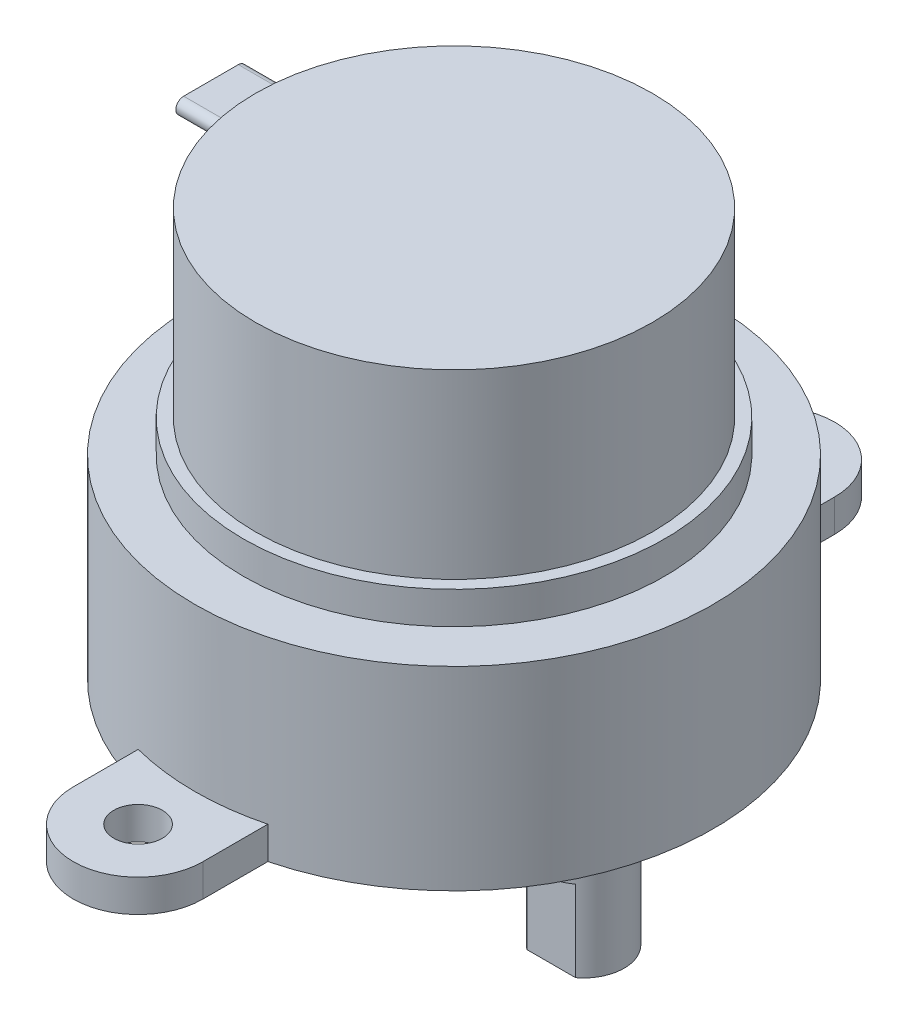
ISO-10303-21;
HEADER;
FILE_DESCRIPTION(('STEP AP214'),'2;1');
FILE_NAME('part.step','',(''),(''),'','','');
FILE_SCHEMA(('AUTOMOTIVE_DESIGN { 1 0 10303 214 1 1 1 1 }'));
ENDSEC;
DATA;
#1=APPLICATION_CONTEXT('core data for automotive mechanical design processes');
#2=APPLICATION_PROTOCOL_DEFINITION('international standard','automotive_design',2000,#1);
#3=PRODUCT_CONTEXT('',#1,'mechanical');
#4=PRODUCT('Part','Part','',(#3));
#5=PRODUCT_RELATED_PRODUCT_CATEGORY('part','',(#4));
#6=PRODUCT_DEFINITION_FORMATION('','',#4);
#7=PRODUCT_DEFINITION_CONTEXT('part definition',#1,'design');
#8=PRODUCT_DEFINITION('design','',#6,#7);
#9=PRODUCT_DEFINITION_SHAPE('','',#8);
#10=(LENGTH_UNIT() NAMED_UNIT(*) SI_UNIT(.MILLI.,.METRE.));
#11=(NAMED_UNIT(*) PLANE_ANGLE_UNIT() SI_UNIT($,.RADIAN.));
#12=(NAMED_UNIT(*) SI_UNIT($,.STERADIAN.) SOLID_ANGLE_UNIT());
#13=UNCERTAINTY_MEASURE_WITH_UNIT(LENGTH_MEASURE(1.E-05),#10,'distance_accuracy_value','');
#14=(GEOMETRIC_REPRESENTATION_CONTEXT(3) GLOBAL_UNCERTAINTY_ASSIGNED_CONTEXT((#13)) GLOBAL_UNIT_ASSIGNED_CONTEXT((#10,
#11,#12)) REPRESENTATION_CONTEXT('',''));
#15=CARTESIAN_POINT('',(0.,0.,0.));
#16=DIRECTION('',(0.,0.,1.));
#17=DIRECTION('',(1.,0.,0.));
#18=AXIS2_PLACEMENT_3D('',#15,#16,#17);
#19=CARTESIAN_POINT('',(8.,-10.2,0.));
#20=DIRECTION('',(0.,-1.,0.));
#21=DIRECTION('',(1.,0.,0.));
#22=AXIS2_PLACEMENT_3D('',#19,#20,#21);
#23=PLANE('',#22);
#24=DIRECTION('',(1.,0.,0.));
#25=VECTOR('',#24,1.);
#26=CARTESIAN_POINT('',(8.,-10.2,2.));
#27=LINE('',#26,#25);
#28=CARTESIAN_POINT('',(6.5,-10.2,2.));
#29=VERTEX_POINT('',#28);
#30=CARTESIAN_POINT('',(9.5,-10.2,2.));
#31=VERTEX_POINT('',#30);
#32=EDGE_CURVE('E247',#29,#31,#27,.T.);
#33=ORIENTED_EDGE('',*,*,#32,.F.);
#34=CARTESIAN_POINT('',(8.,-10.2,0.));
#35=DIRECTION('',(0.,1.,0.));
#36=DIRECTION('',(-1.,0.,0.));
#37=AXIS2_PLACEMENT_3D('',#34,#35,#36);
#38=CIRCLE('',#37,2.5);
#39=CARTESIAN_POINT('',(6.5,-10.2,-2.));
#40=VERTEX_POINT('',#39);
#41=EDGE_CURVE('E271',#40,#29,#38,.T.);
#42=ORIENTED_EDGE('',*,*,#41,.F.);
#43=DIRECTION('',(1.,0.,0.));
#44=VECTOR('',#43,1.);
#45=CARTESIAN_POINT('',(8.,-10.2,-2.));
#46=LINE('',#45,#44);
#47=CARTESIAN_POINT('',(9.5,-10.2,-2.));
#48=VERTEX_POINT('',#47);
#49=EDGE_CURVE('E249',#40,#48,#46,.T.);
#50=ORIENTED_EDGE('',*,*,#49,.T.);
#51=EDGE_CURVE('E274',#31,#48,#38,.T.);
#52=ORIENTED_EDGE('',*,*,#51,.F.);
#53=EDGE_LOOP('',(#33,#42,#50,#52));
#54=FACE_BOUND('',#53,.T.);
#55=CARTESIAN_POINT('',(8.,-10.2,0.));
#56=DIRECTION('',(0.,-1.,0.));
#57=DIRECTION('',(0.,0.,-1.));
#58=AXIS2_PLACEMENT_3D('',#55,#56,#57);
#59=CIRCLE('',#58,1.65);
#60=CARTESIAN_POINT('',(8.,-10.2,-1.65));
#61=VERTEX_POINT('',#60);
#62=EDGE_CURVE('E246',#61,#61,#59,.T.);
#63=ORIENTED_EDGE('',*,*,#62,.F.);
#64=EDGE_LOOP('',(#63));
#65=FACE_BOUND('',#64,.T.);
#66=ADVANCED_FACE('F43',(#54,#65),#23,.T.);
#67=CARTESIAN_POINT('',(8.,0.,0.));
#68=DIRECTION('',(0.,1.,0.));
#69=DIRECTION('',(-1.,0.,0.));
#70=AXIS2_PLACEMENT_3D('',#67,#68,#69);
#71=CYLINDRICAL_SURFACE('',#70,2.5);
#72=DIRECTION('',(0.,1.,0.));
#73=VECTOR('',#72,1.);
#74=CARTESIAN_POINT('',(6.5,0.,2.));
#75=LINE('',#74,#73);
#76=CARTESIAN_POINT('',(6.5,-5.2,2.));
#77=VERTEX_POINT('',#76);
#78=EDGE_CURVE('E311',#77,#29,#75,.F.);
#79=ORIENTED_EDGE('',*,*,#78,.F.);
#80=CARTESIAN_POINT('',(8.,-5.2,0.));
#81=DIRECTION('',(0.,-1.,0.));
#82=DIRECTION('',(1.,0.,0.));
#83=AXIS2_PLACEMENT_3D('',#80,#81,#82);
#84=CIRCLE('',#83,2.5);
#85=CARTESIAN_POINT('',(9.5,-5.2,2.));
#86=VERTEX_POINT('',#85);
#87=EDGE_CURVE('E305',#77,#86,#84,.F.);
#88=ORIENTED_EDGE('',*,*,#87,.T.);
#89=DIRECTION('',(0.,1.,0.));
#90=VECTOR('',#89,1.);
#91=CARTESIAN_POINT('',(9.5,0.,2.));
#92=LINE('',#91,#90);
#93=EDGE_CURVE('E308',#31,#86,#92,.T.);
#94=ORIENTED_EDGE('',*,*,#93,.F.);
#95=ORIENTED_EDGE('',*,*,#51,.T.);
#96=DIRECTION('',(0.,1.,0.));
#97=VECTOR('',#96,1.);
#98=CARTESIAN_POINT('',(9.5,0.,-2.));
#99=LINE('',#98,#97);
#100=CARTESIAN_POINT('',(9.5,-5.2,-2.));
#101=VERTEX_POINT('',#100);
#102=EDGE_CURVE('E299',#48,#101,#99,.T.);
#103=ORIENTED_EDGE('',*,*,#102,.T.);
#104=CARTESIAN_POINT('',(8.,-5.2,0.));
#105=DIRECTION('',(0.,-1.,0.));
#106=DIRECTION('',(1.,0.,0.));
#107=AXIS2_PLACEMENT_3D('',#104,#105,#106);
#108=CIRCLE('',#107,2.5);
#109=CARTESIAN_POINT('',(6.5,-5.2,-2.));
#110=VERTEX_POINT('',#109);
#111=EDGE_CURVE('E296',#101,#110,#108,.F.);
#112=ORIENTED_EDGE('',*,*,#111,.T.);
#113=DIRECTION('',(0.,1.,0.));
#114=VECTOR('',#113,1.);
#115=CARTESIAN_POINT('',(6.5,0.,-2.));
#116=LINE('',#115,#114);
#117=EDGE_CURVE('E302',#110,#40,#116,.F.);
#118=ORIENTED_EDGE('',*,*,#117,.T.);
#119=ORIENTED_EDGE('',*,*,#41,.T.);
#120=EDGE_LOOP('',(#79,#88,#94,#95,#103,#112,#118,#119));
#121=FACE_BOUND('',#120,.T.);
#122=CARTESIAN_POINT('',(8.,-2.7,0.));
#123=DIRECTION('',(0.,1.,0.));
#124=DIRECTION('',(-1.,0.,0.));
#125=AXIS2_PLACEMENT_3D('',#122,#123,#124);
#126=CIRCLE('',#125,2.5);
#127=CARTESIAN_POINT('',(5.5,-2.7,0.));
#128=VERTEX_POINT('',#127);
#129=EDGE_CURVE('E268',#128,#128,#126,.T.);
#130=ORIENTED_EDGE('',*,*,#129,.F.);
#131=EDGE_LOOP('',(#130));
#132=FACE_BOUND('',#131,.T.);
#133=ADVANCED_FACE('F421',(#121,#132),#71,.T.);
#134=CARTESIAN_POINT('',(0.,0.,0.));
#135=DIRECTION('',(0.,-1.,0.));
#136=DIRECTION('',(0.,0.,-1.));
#137=AXIS2_PLACEMENT_3D('',#134,#135,#136);
#138=PLANE('',#137);
#139=CARTESIAN_POINT('',(8.,0.,0.));
#140=DIRECTION('',(0.,-1.,0.));
#141=DIRECTION('',(0.,0.,-1.));
#142=AXIS2_PLACEMENT_3D('',#139,#140,#141);
#143=CIRCLE('',#142,4.5);
#144=CARTESIAN_POINT('',(8.,0.,-4.5));
#145=VERTEX_POINT('',#144);
#146=EDGE_CURVE('E293',#145,#145,#143,.T.);
#147=ORIENTED_EDGE('',*,*,#146,.F.);
#148=EDGE_LOOP('',(#147));
#149=FACE_BOUND('',#148,.T.);
#150=CARTESIAN_POINT('',(0.,0.,0.));
#151=DIRECTION('',(0.,1.,0.));
#152=DIRECTION('',(0.,0.,1.));
#153=AXIS2_PLACEMENT_3D('',#150,#151,#152);
#154=CIRCLE('',#153,16.);
#155=CARTESIAN_POINT('',(-4.,0.,-15.4919333848297));
#156=VERTEX_POINT('',#155);
#157=CARTESIAN_POINT('',(-4.00000000000001,0.,15.4919333848297));
#158=VERTEX_POINT('',#157);
#159=EDGE_CURVE('E290',#156,#158,#154,.T.);
#160=ORIENTED_EDGE('',*,*,#159,.F.);
#161=DIRECTION('',(0.,0.,-1.));
#162=VECTOR('',#161,1.);
#163=CARTESIAN_POINT('',(-4.00000000000001,0.,19.5));
#164=LINE('',#163,#162);
#165=CARTESIAN_POINT('',(-4.,0.,-19.5));
#166=VERTEX_POINT('',#165);
#167=EDGE_CURVE('E224',#156,#166,#164,.T.);
#168=ORIENTED_EDGE('',*,*,#167,.T.);
#169=CARTESIAN_POINT('',(0.,0.,-19.5));
#170=DIRECTION('',(0.,-1.,0.));
#171=DIRECTION('',(0.,0.,-1.));
#172=AXIS2_PLACEMENT_3D('',#169,#170,#171);
#173=CIRCLE('',#172,4.);
#174=CARTESIAN_POINT('',(4.00000000000001,0.,-19.5));
#175=VERTEX_POINT('',#174);
#176=EDGE_CURVE('E228',#166,#175,#173,.T.);
#177=ORIENTED_EDGE('',*,*,#176,.T.);
#178=DIRECTION('',(0.,0.,1.));
#179=VECTOR('',#178,1.);
#180=CARTESIAN_POINT('',(3.99999999999999,0.,19.5));
#181=LINE('',#180,#179);
#182=CARTESIAN_POINT('',(4.,0.,-15.4919333848297));
#183=VERTEX_POINT('',#182);
#184=EDGE_CURVE('E210',#175,#183,#181,.T.);
#185=ORIENTED_EDGE('',*,*,#184,.T.);
#186=CARTESIAN_POINT('',(3.99999999999999,0.,15.4919333848297));
#187=VERTEX_POINT('',#186);
#188=EDGE_CURVE('E291',#187,#183,#154,.T.);
#189=ORIENTED_EDGE('',*,*,#188,.F.);
#190=CARTESIAN_POINT('',(3.99999999999999,0.,19.5));
#191=VERTEX_POINT('',#190);
#192=EDGE_CURVE('E231',#187,#191,#181,.T.);
#193=ORIENTED_EDGE('',*,*,#192,.T.);
#194=CARTESIAN_POINT('',(0.,0.,19.5));
#195=DIRECTION('',(0.,-1.,0.));
#196=DIRECTION('',(0.,0.,-1.));
#197=AXIS2_PLACEMENT_3D('',#194,#195,#196);
#198=CIRCLE('',#197,4.);
#199=CARTESIAN_POINT('',(-4.00000000000001,0.,19.5));
#200=VERTEX_POINT('',#199);
#201=EDGE_CURVE('E203',#191,#200,#198,.T.);
#202=ORIENTED_EDGE('',*,*,#201,.T.);
#203=EDGE_CURVE('E225',#200,#158,#164,.T.);
#204=ORIENTED_EDGE('',*,*,#203,.T.);
#205=EDGE_LOOP('',(#160,#168,#177,#185,#189,#193,#202,#204));
#206=FACE_BOUND('',#205,.T.);
#207=CARTESIAN_POINT('',(0.,0.,-19.5));
#208=DIRECTION('',(0.,-1.,0.));
#209=DIRECTION('',(0.,0.,-1.));
#210=AXIS2_PLACEMENT_3D('',#207,#208,#209);
#211=CIRCLE('',#210,1.5);
#212=CARTESIAN_POINT('',(0.,0.,-21.));
#213=VERTEX_POINT('',#212);
#214=EDGE_CURVE('E197',#213,#213,#211,.T.);
#215=ORIENTED_EDGE('',*,*,#214,.F.);
#216=EDGE_LOOP('',(#215));
#217=FACE_BOUND('',#216,.T.);
#218=CARTESIAN_POINT('',(0.,0.,19.5));
#219=DIRECTION('',(0.,-1.,0.));
#220=DIRECTION('',(0.,0.,-1.));
#221=AXIS2_PLACEMENT_3D('',#218,#219,#220);
#222=CIRCLE('',#221,1.5);
#223=CARTESIAN_POINT('',(0.,0.,18.));
#224=VERTEX_POINT('',#223);
#225=EDGE_CURVE('E189',#224,#224,#222,.T.);
#226=ORIENTED_EDGE('',*,*,#225,.F.);
#227=EDGE_LOOP('',(#226));
#228=FACE_BOUND('',#227,.T.);
#229=ADVANCED_FACE('F45',(#149,#206,#217,#228),#138,.T.);
#230=CARTESIAN_POINT('',(0.,25.2,0.));
#231=DIRECTION('',(0.,1.,0.));
#232=DIRECTION('',(0.,0.,1.));
#233=AXIS2_PLACEMENT_3D('',#230,#231,#232);
#234=CYLINDRICAL_SURFACE('',#233,16.);
#235=DIRECTION('',(0.,1.,0.));
#236=VECTOR('',#235,1.);
#237=CARTESIAN_POINT('',(3.99999999999999,25.2,15.4919333848297));
#238=LINE('',#237,#236);
#239=CARTESIAN_POINT('',(3.99999999999999,2.,15.4919333848297));
#240=VERTEX_POINT('',#239);
#241=EDGE_CURVE('E325',#187,#240,#238,.T.);
#242=ORIENTED_EDGE('',*,*,#241,.F.);
#243=ORIENTED_EDGE('',*,*,#188,.T.);
#244=DIRECTION('',(0.,1.,0.));
#245=VECTOR('',#244,1.);
#246=CARTESIAN_POINT('',(4.,25.2,-15.4919333848297));
#247=LINE('',#246,#245);
#248=CARTESIAN_POINT('',(4.,2.,-15.4919333848297));
#249=VERTEX_POINT('',#248);
#250=EDGE_CURVE('E319',#249,#183,#247,.F.);
#251=ORIENTED_EDGE('',*,*,#250,.F.);
#252=CARTESIAN_POINT('',(0.,2.,0.));
#253=DIRECTION('',(0.,-1.,0.));
#254=DIRECTION('',(0.,0.,-1.));
#255=AXIS2_PLACEMENT_3D('',#252,#253,#254);
#256=CIRCLE('',#255,16.);
#257=CARTESIAN_POINT('',(-4.,2.,-15.4919333848297));
#258=VERTEX_POINT('',#257);
#259=EDGE_CURVE('E313',#249,#258,#256,.F.);
#260=ORIENTED_EDGE('',*,*,#259,.T.);
#261=DIRECTION('',(0.,1.,0.));
#262=VECTOR('',#261,1.);
#263=CARTESIAN_POINT('',(-4.,25.2,-15.4919333848297));
#264=LINE('',#263,#262);
#265=EDGE_CURVE('E315',#156,#258,#264,.T.);
#266=ORIENTED_EDGE('',*,*,#265,.F.);
#267=ORIENTED_EDGE('',*,*,#159,.T.);
#268=DIRECTION('',(0.,1.,0.));
#269=VECTOR('',#268,1.);
#270=CARTESIAN_POINT('',(-4.00000000000001,25.2,15.4919333848297));
#271=LINE('',#270,#269);
#272=CARTESIAN_POINT('',(-4.00000000000001,2.,15.4919333848297));
#273=VERTEX_POINT('',#272);
#274=EDGE_CURVE('E322',#273,#158,#271,.F.);
#275=ORIENTED_EDGE('',*,*,#274,.F.);
#276=EDGE_CURVE('E316',#273,#240,#256,.F.);
#277=ORIENTED_EDGE('',*,*,#276,.T.);
#278=EDGE_LOOP('',(#242,#243,#251,#260,#266,#267,#275,#277));
#279=FACE_BOUND('',#278,.T.);
#280=CARTESIAN_POINT('',(0.,12.,0.));
#281=DIRECTION('',(0.,1.,0.));
#282=DIRECTION('',(0.,0.,1.));
#283=AXIS2_PLACEMENT_3D('',#280,#281,#282);
#284=CIRCLE('',#283,16.);
#285=CARTESIAN_POINT('',(0.,12.,16.));
#286=VERTEX_POINT('',#285);
#287=EDGE_CURVE('E287',#286,#286,#284,.T.);
#288=ORIENTED_EDGE('',*,*,#287,.F.);
#289=EDGE_LOOP('',(#288));
#290=FACE_BOUND('',#289,.T.);
#291=ADVANCED_FACE('F541',(#279,#290),#234,.T.);
#292=CARTESIAN_POINT('',(-16.,12.,0.));
#293=DIRECTION('',(0.,1.,0.));
#294=DIRECTION('',(0.,0.,1.));
#295=AXIS2_PLACEMENT_3D('',#292,#293,#294);
#296=PLANE('',#295);
#297=ORIENTED_EDGE('',*,*,#287,.T.);
#298=EDGE_LOOP('',(#297));
#299=FACE_BOUND('',#298,.T.);
#300=CARTESIAN_POINT('',(0.,12.,0.));
#301=DIRECTION('',(0.,1.,0.));
#302=DIRECTION('',(0.,0.,1.));
#303=AXIS2_PLACEMENT_3D('',#300,#301,#302);
#304=CIRCLE('',#303,13.);
#305=CARTESIAN_POINT('',(0.,12.,13.));
#306=VERTEX_POINT('',#305);
#307=EDGE_CURVE('E284',#306,#306,#304,.T.);
#308=ORIENTED_EDGE('',*,*,#307,.F.);
#309=EDGE_LOOP('',(#308));
#310=FACE_BOUND('',#309,.T.);
#311=ADVANCED_FACE('F626',(#299,#310),#296,.T.);
#312=CARTESIAN_POINT('',(0.,25.2,0.));
#313=DIRECTION('',(0.,1.,0.));
#314=DIRECTION('',(0.,0.,1.));
#315=AXIS2_PLACEMENT_3D('',#312,#313,#314);
#316=CYLINDRICAL_SURFACE('',#315,13.);
#317=ORIENTED_EDGE('',*,*,#307,.T.);
#318=EDGE_LOOP('',(#317));
#319=FACE_BOUND('',#318,.T.);
#320=CARTESIAN_POINT('',(0.,14.,0.));
#321=DIRECTION('',(0.,1.,0.));
#322=DIRECTION('',(0.,0.,1.));
#323=AXIS2_PLACEMENT_3D('',#320,#321,#322);
#324=CIRCLE('',#323,13.);
#325=CARTESIAN_POINT('',(0.,14.,13.));
#326=VERTEX_POINT('',#325);
#327=EDGE_CURVE('E281',#326,#326,#324,.T.);
#328=ORIENTED_EDGE('',*,*,#327,.F.);
#329=EDGE_LOOP('',(#328));
#330=FACE_BOUND('',#329,.T.);
#331=ADVANCED_FACE('F438',(#319,#330),#316,.T.);
#332=CARTESIAN_POINT('',(-13.,14.,0.));
#333=DIRECTION('',(0.,1.,0.));
#334=DIRECTION('',(0.,0.,1.));
#335=AXIS2_PLACEMENT_3D('',#332,#333,#334);
#336=PLANE('',#335);
#337=ORIENTED_EDGE('',*,*,#327,.T.);
#338=EDGE_LOOP('',(#337));
#339=FACE_BOUND('',#338,.T.);
#340=CARTESIAN_POINT('',(0.,14.,0.));
#341=DIRECTION('',(0.,1.,0.));
#342=DIRECTION('',(0.,0.,1.));
#343=AXIS2_PLACEMENT_3D('',#340,#341,#342);
#344=CIRCLE('',#343,12.25);
#345=CARTESIAN_POINT('',(0.,14.,12.25));
#346=VERTEX_POINT('',#345);
#347=EDGE_CURVE('E278',#346,#346,#344,.T.);
#348=ORIENTED_EDGE('',*,*,#347,.F.);
#349=EDGE_LOOP('',(#348));
#350=FACE_BOUND('',#349,.T.);
#351=ADVANCED_FACE('F432',(#339,#350),#336,.T.);
#352=CARTESIAN_POINT('',(0.,25.2,0.));
#353=DIRECTION('',(0.,1.,0.));
#354=DIRECTION('',(0.,0.,1.));
#355=AXIS2_PLACEMENT_3D('',#352,#353,#354);
#356=CYLINDRICAL_SURFACE('',#355,12.25);
#357=CARTESIAN_POINT('',(-12.1905435397056,24.0320369505729,1.20546597071078));
#358=CARTESIAN_POINT('',(-12.1905435012499,24.0050757793296,1.2054671730936));
#359=CARTESIAN_POINT('',(-12.1903197040446,23.9780952843022,1.20773624723784));
#360=CARTESIAN_POINT('',(-12.1894228003005,23.9248788592117,1.2167545089782));
#361=CARTESIAN_POINT('',(-12.1887491600743,23.8986438521735,1.22350901797617));
#362=CARTESIAN_POINT('',(-12.1869501990387,23.8476979729114,1.24129944408047));
#363=CARTESIAN_POINT('',(-12.1858251227662,23.8229862838732,1.2523330431516));
#364=CARTESIAN_POINT('',(-12.1831225050948,23.775778748105,1.27835688473153));
#365=CARTESIAN_POINT('',(-12.1815450736988,23.7532823644457,1.29334616523422));
#366=CARTESIAN_POINT('',(-12.1779385325519,23.711092276896,1.32687490076655));
#367=CARTESIAN_POINT('',(-12.1759086741891,23.6914033078953,1.34542023265758));
#368=CARTESIAN_POINT('',(-12.1714121269447,23.6554182031972,1.38550814563087));
#369=CARTESIAN_POINT('',(-12.1689454138762,23.6391222554669,1.40705089265417));
#370=CARTESIAN_POINT('',(-12.1635900460829,23.6103009701968,1.45262008377879));
#371=CARTESIAN_POINT('',(-12.1606994892098,23.5977934540374,1.47665757381244));
#372=CARTESIAN_POINT('',(-12.1545503684794,23.5769854458427,1.5264448816904));
#373=CARTESIAN_POINT('',(-12.1512917918647,23.5686850997031,1.55219475888161));
#374=CARTESIAN_POINT('',(-12.144447471839,23.5564606030434,1.604869329746));
#375=CARTESIAN_POINT('',(-12.1408595461987,23.5525683200987,1.63180113446188));
#376=CARTESIAN_POINT('',(-12.1334647121339,23.5493593098075,1.68590617651896));
#377=CARTESIAN_POINT('',(-12.1296577936364,23.5500427930989,1.71307942491712));
#378=CARTESIAN_POINT('',(-12.1219038061946,23.5559774927709,1.76711597384195));
#379=CARTESIAN_POINT('',(-12.1179558915977,23.5612634064243,1.7939753457505));
#380=CARTESIAN_POINT('',(-12.1100761730619,23.5762981332218,1.84641780251325));
#381=CARTESIAN_POINT('',(-12.1061443696983,23.5860471043585,1.87200084214961));
#382=CARTESIAN_POINT('',(-12.0984255130768,23.6097818506463,1.92125591181519));
#383=CARTESIAN_POINT('',(-12.0946390062893,23.6237821336265,1.94492104090826));
#384=CARTESIAN_POINT('',(-12.0873758656222,23.6556253297241,1.98956199183505));
#385=CARTESIAN_POINT('',(-12.0838992271852,23.6734681863131,2.01053785322361));
#386=CARTESIAN_POINT('',(-12.0774222434573,23.712405753587,2.04908587228766));
#387=CARTESIAN_POINT('',(-12.074419571825,23.7334835117046,2.06667475408244));
#388=CARTESIAN_POINT('',(-12.0690072136481,23.7783685320108,2.09805129395549));
#389=CARTESIAN_POINT('',(-12.0665974837122,23.8021755942831,2.11183923019439));
#390=CARTESIAN_POINT('',(-12.062514782716,23.8515160837554,2.13503506026259));
#391=CARTESIAN_POINT('',(-12.060832692386,23.8770232232927,2.14449725813551));
#392=CARTESIAN_POINT('',(-12.0582440824894,23.9293012580241,2.15900544652698));
#393=CARTESIAN_POINT('',(-12.0573374958739,23.9560720437539,2.16405181883207));
#394=CARTESIAN_POINT('',(-12.0563526642522,24.0097383125865,2.16953178604423));
#395=CARTESIAN_POINT('',(-12.0562636422963,24.0366274843109,2.17002539481095));
#396=CARTESIAN_POINT('',(-12.0568902009854,24.090104284554,2.16654141912804));
#397=CARTESIAN_POINT('',(-12.0576057520628,24.1166919241174,2.16256399898589));
#398=CARTESIAN_POINT('',(-12.0598008827825,24.1686969065696,2.15028856217173));
#399=CARTESIAN_POINT('',(-12.0612772188499,24.1941187227708,2.14200888674511));
#400=CARTESIAN_POINT('',(-12.0649205661979,24.2432055471667,2.12139121618982));
#401=CARTESIAN_POINT('',(-12.0670875994858,24.266870499354,2.10905309174882));
#402=CARTESIAN_POINT('',(-12.0720307794247,24.3119748392603,2.08057265396402));
#403=CARTESIAN_POINT('',(-12.0748114954157,24.3333956526166,2.0644017318684));
#404=CARTESIAN_POINT('',(-12.0808481910291,24.37322773098,2.02877614272206));
#405=CARTESIAN_POINT('',(-12.0841042056802,24.3916387739611,2.0093212336318));
#406=CARTESIAN_POINT('',(-12.0910038281863,24.4252027461922,1.96737986325894));
#407=CARTESIAN_POINT('',(-12.0946522376951,24.4403062809482,1.94485465990348));
#408=CARTESIAN_POINT('',(-12.1021530273542,24.4665204025591,1.89762044937008));
#409=CARTESIAN_POINT('',(-12.1060054208915,24.4776307269781,1.87291129879497));
#410=CARTESIAN_POINT('',(-12.1138171436033,24.4956618754467,1.82170573311311));
#411=CARTESIAN_POINT('',(-12.1177771872336,24.5025343789089,1.79519239890742));
#412=CARTESIAN_POINT('',(-12.1256279167509,24.5116988074441,1.74137499958991));
#413=CARTESIAN_POINT('',(-12.1295186008934,24.5139906174725,1.71407091463579));
#414=CARTESIAN_POINT('',(-12.1371231292605,24.5139192131256,1.65936933905878));
#415=CARTESIAN_POINT('',(-12.140836477567,24.5115436475508,1.631971792646));
#416=CARTESIAN_POINT('',(-12.1479768862296,24.5021639884238,1.57794181657638));
#417=CARTESIAN_POINT('',(-12.1514039523337,24.4951599878262,1.55130937156492));
#418=CARTESIAN_POINT('',(-12.1578793695262,24.4767522623495,1.4997141269323));
#419=CARTESIAN_POINT('',(-12.1609295309159,24.4653707423738,1.47474363510682));
#420=CARTESIAN_POINT('',(-12.1666174313861,24.4385153545098,1.42705904552516));
#421=CARTESIAN_POINT('',(-12.1692552032886,24.4230418125677,1.40434476825044));
#422=CARTESIAN_POINT('',(-12.1740653584249,24.3885743710585,1.36201457997041));
#423=CARTESIAN_POINT('',(-12.1762412904544,24.369609575727,1.34237537127156));
#424=CARTESIAN_POINT('',(-12.1801373066534,24.3286072011266,1.30655302241191));
#425=CARTESIAN_POINT('',(-12.1818572947248,24.3065689755701,1.29037061097071));
#426=CARTESIAN_POINT('',(-12.1848253067857,24.260199439062,1.2620358998136));
#427=CARTESIAN_POINT('',(-12.1860761591574,24.2358830121366,1.24985950466732));
#428=CARTESIAN_POINT('',(-12.1881199239271,24.1855536644508,1.22977056999881));
#429=CARTESIAN_POINT('',(-12.1889133929138,24.1595428486928,1.22185284889665));
#430=CARTESIAN_POINT('',(-12.1898347448564,24.1164774506671,1.21261730170903));
#431=CARTESIAN_POINT('',(-12.1901005263551,24.0997052588665,1.20993902181783));
#432=CARTESIAN_POINT('',(-12.1904549357028,24.0659702466482,1.20636297971113));
#433=CARTESIAN_POINT('',(-12.1905435639113,24.0490074266175,1.20546521388131));
#434=CARTESIAN_POINT('',(-12.1905435397056,24.0320369505729,1.20546597071078));
#435=B_SPLINE_CURVE_WITH_KNOTS('',3,(#357,#358,#359,#360,#361,#362,#363,#364,#365,#366,#367,
#368,#369,#370,#371,#372,#373,#374,#375,#376,#377,#378,#379,#380,#381,#382,#383,#384,#385,#386,
#387,#388,#389,#390,#391,#392,#393,#394,#395,#396,#397,#398,#399,#400,#401,#402,#403,#404,#405,
#406,#407,#408,#409,#410,#411,#412,#413,#414,#415,#416,#417,#418,#419,#420,#421,#422,#423,#424,
#425,#426,#427,#428,#429,#430,#431,#432,#433,#434),.UNSPECIFIED.,.T.,.F.,(4,2,2,2,2,2,2,2,2,2,2,
2,2,2,2,2,2,2,2,2,2,2,2,2,2,2,2,2,2,2,2,2,2,2,2,2,2,2,4),(0.,0.0808214892207497,
0.161739034639515,0.24261280712845,0.32346692953158,0.404455844396228,0.48544924470447,
0.566817936092876,0.648189448980757,0.730145545791662,0.812105415342341,0.894688575181678,
0.977274658698321,1.06014580072238,1.14301572370391,1.22546532674924,1.30790889436838,
1.38928697419883,1.47065801749077,1.55095488167011,1.63124879508709,1.71120317673186,
1.79116010616982,1.8717337664672,1.9523133678763,2.03402476287115,2.11574152699765,
2.19837360181072,2.28100775190985,2.36386086994333,2.44671232405601,2.52914894291391,
2.61157899733601,2.69335068185404,2.77513958750123,2.85642714998898,2.93761558389772,
2.98848807450796,3.03936046185087),.UNSPECIFIED.);
#436=CARTESIAN_POINT('',(-12.1332285033202,23.5501185293271,1.68738439195662));
#437=VERTEX_POINT('',#436);
#438=CARTESIAN_POINT('',(-12.1332285033202,24.5139553718188,1.68738439195662));
#439=VERTEX_POINT('',#438);
#440=EDGE_CURVE('E11',#437,#439,#435,.T.);
#441=ORIENTED_EDGE('',*,*,#440,.F.);
#442=CARTESIAN_POINT('',(0.,23.5501185293271,0.));
#443=DIRECTION('',(0.,-1.,0.));
#444=DIRECTION('',(0.,0.,-1.));
#445=AXIS2_PLACEMENT_3D('',#442,#443,#444);
#446=CIRCLE('',#445,12.25);
#447=CARTESIAN_POINT('',(-12.1332285033202,23.5501185293271,-1.68738439195662));
#448=VERTEX_POINT('',#447);
#449=EDGE_CURVE('E166',#448,#437,#446,.F.);
#450=ORIENTED_EDGE('',*,*,#449,.F.);
#451=CARTESIAN_POINT('',(-12.0563935446978,24.0320369505729,-2.16930281320247));
#452=CARTESIAN_POINT('',(-12.056393847907,24.0052648889372,-2.16930157726292));
#453=CARTESIAN_POINT('',(-12.056797069414,23.9784734764431,-2.16706382866046));
#454=CARTESIAN_POINT('',(-12.0583913379277,23.9256354906891,-2.15817467166095));
#455=CARTESIAN_POINT('',(-12.059583326108,23.8995898460772,-2.15151799046674));
#456=CARTESIAN_POINT('',(-12.062695340425,23.8490228826341,-2.13400087368216));
#457=CARTESIAN_POINT('',(-12.0646147416616,23.8245002763903,-2.12314404615292));
#458=CARTESIAN_POINT('',(-12.0690897357464,23.7776408426813,-2.09755591920282));
#459=CARTESIAN_POINT('',(-12.0716451989764,23.7553035711736,-2.0828254091358));
#460=CARTESIAN_POINT('',(-12.0772991779534,23.7132415622741,-2.04978701937372));
#461=CARTESIAN_POINT('',(-12.0804018357658,23.6935389254614,-2.03145172169063));
#462=CARTESIAN_POINT('',(-12.0870023033117,23.6574798099476,-1.99180282890888));
#463=CARTESIAN_POINT('',(-12.090500155456,23.6411236909133,-1.9704889140976));
#464=CARTESIAN_POINT('',(-12.0978016230777,23.6119825127118,-1.92515700794351));
#465=CARTESIAN_POINT('',(-12.1016088566656,23.5992511011696,-1.9011051036379));
#466=CARTESIAN_POINT('',(-12.1093401639479,23.5780126183575,-1.85122051140485));
#467=CARTESIAN_POINT('',(-12.1132642441488,23.5695057828018,-1.82538772420291));
#468=CARTESIAN_POINT('',(-12.1211278077275,23.5568934341366,-1.77242298821644));
#469=CARTESIAN_POINT('',(-12.12506711923,23.5528276104669,-1.74528155192992));
#470=CARTESIAN_POINT('',(-12.132800865359,23.549354018746,-1.69068131781343));
#471=CARTESIAN_POINT('',(-12.1365952991903,23.5499462762492,-1.66322251824323));
#472=CARTESIAN_POINT('',(-12.1439329561401,23.5557858831211,-1.60877192583547));
#473=CARTESIAN_POINT('',(-12.1474762025095,23.5610328010218,-1.58178008994871));
#474=CARTESIAN_POINT('',(-12.1542272952157,23.5760497244404,-1.529040880264));
#475=CARTESIAN_POINT('',(-12.157435151564,23.5858195948962,-1.50329346933102));
#476=CARTESIAN_POINT('',(-12.1634336960273,23.6095419824008,-1.45395838233849));
#477=CARTESIAN_POINT('',(-12.16622694996,23.6234670170138,-1.43035780562921));
#478=CARTESIAN_POINT('',(-12.1713802264433,23.6551379511554,-1.38582346116579));
#479=CARTESIAN_POINT('',(-12.1737402671159,23.6728836907909,-1.36488958187101));
#480=CARTESIAN_POINT('',(-12.1779872289191,23.7115424574298,-1.32646100224987));
#481=CARTESIAN_POINT('',(-12.1798777004978,23.7324296707273,-1.30894072354572));
#482=CARTESIAN_POINT('',(-12.1831994628998,23.7768805290607,-1.27765378103302));
#483=CARTESIAN_POINT('',(-12.1846307685579,23.8004440875947,-1.26388699595715));
#484=CARTESIAN_POINT('',(-12.1870255498931,23.8494306789966,-1.24058266682874));
#485=CARTESIAN_POINT('',(-12.1879916895063,23.8748421405151,-1.2310210682757));
#486=CARTESIAN_POINT('',(-12.1894704297474,23.9269206548589,-1.2162918715487));
#487=CARTESIAN_POINT('',(-12.1899830390183,23.9535876837467,-1.21112418963993));
#488=CARTESIAN_POINT('',(-12.1905559977113,24.0073331724988,-1.20534353775981));
#489=CARTESIAN_POINT('',(-12.1906177204429,24.0344101311086,-1.20471673722656));
#490=CARTESIAN_POINT('',(-12.1902928490205,24.0882847696312,-1.20799953390413));
#491=CARTESIAN_POINT('',(-12.189906258582,24.1150824518569,-1.21190909351624));
#492=CARTESIAN_POINT('',(-12.1886834708132,24.1676177183915,-1.22414566909676));
#493=CARTESIAN_POINT('',(-12.1878476051388,24.1933560696315,-1.23246942643242));
#494=CARTESIAN_POINT('',(-12.1857242071064,24.2430655395045,-1.25328943442098));
#495=CARTESIAN_POINT('',(-12.1844366745201,24.2670366572445,-1.26578568718167));
#496=CARTESIAN_POINT('',(-12.1814081180072,24.31256806326,-1.29460638136399));
#497=CARTESIAN_POINT('',(-12.1796664877584,24.3341250727247,-1.31093593817919));
#498=CARTESIAN_POINT('',(-12.1757373791546,24.3741891260939,-1.3469396195142));
#499=CARTESIAN_POINT('',(-12.173549894887,24.3926961295447,-1.36661378838802));
#500=CARTESIAN_POINT('',(-12.1687378552587,24.4262140569439,-1.40881898667043));
#501=CARTESIAN_POINT('',(-12.1661116808327,24.4412115169069,-1.43136052225706));
#502=CARTESIAN_POINT('',(-12.1604615910709,24.4672134758017,-1.47859357479068));
#503=CARTESIAN_POINT('',(-12.1574376640565,24.478217857457,-1.50328515485797));
#504=CARTESIAN_POINT('',(-12.1510234169697,24.4960015954232,-1.55428248821578));
#505=CARTESIAN_POINT('',(-12.1476308512723,24.502753133198,-1.58059765810693));
#506=CARTESIAN_POINT('',(-12.1405694579091,24.5117475684475,-1.63395141463969));
#507=CARTESIAN_POINT('',(-12.1369006169758,24.5139902492498,-1.66099003598337));
#508=CARTESIAN_POINT('',(-12.1293518885704,24.513919396376,-1.71524890424983));
#509=CARTESIAN_POINT('',(-12.1254705678195,24.5115698789877,-1.74246890654682));
#510=CARTESIAN_POINT('',(-12.1176403831772,24.5023178352959,-1.79611434352927));
#511=CARTESIAN_POINT('',(-12.1136915163416,24.4954151100234,-1.82253974343891));
#512=CARTESIAN_POINT('',(-12.1058383032031,24.4772002621355,-1.87399584336961));
#513=CARTESIAN_POINT('',(-12.101934310194,24.4658646428938,-1.89901828515963));
#514=CARTESIAN_POINT('',(-12.0943394746571,24.4390967581086,-1.94680216421307));
#515=CARTESIAN_POINT('',(-12.0906486250459,24.423664628801,-1.96956367663272));
#516=CARTESIAN_POINT('',(-12.0836388652939,24.3891634466185,-2.01212244018256));
#517=CARTESIAN_POINT('',(-12.0803191576846,24.3701024391033,-2.03192607889161));
#518=CARTESIAN_POINT('',(-12.0741880893462,24.3288416201249,-2.0680470495058));
#519=CARTESIAN_POINT('',(-12.0713768266539,24.3066412047976,-2.08436370917182));
#520=CARTESIAN_POINT('',(-12.0664223370793,24.2599825463719,-2.11285579178028));
#521=CARTESIAN_POINT('',(-12.0642724289546,24.2355503543748,-2.12507275414091));
#522=CARTESIAN_POINT('',(-12.0607083431484,24.1849484601543,-2.14520858908673));
#523=CARTESIAN_POINT('',(-12.0592932021724,24.1587810838376,-2.15313308976862));
#524=CARTESIAN_POINT('',(-12.0576549786528,24.115701626992,-2.16228305593076));
#525=CARTESIAN_POINT('',(-12.057182916556,24.0990839128463,-2.16491185431848));
#526=CARTESIAN_POINT('',(-12.0565521058396,24.0656589926201,-2.16842211283159));
#527=CARTESIAN_POINT('',(-12.0563933542601,24.0488517883312,-2.16930358946405));
#528=CARTESIAN_POINT('',(-12.0563935446978,24.0320369505729,-2.16930281320247));
#529=B_SPLINE_CURVE_WITH_KNOTS('',3,(#451,#452,#453,#454,#455,#456,#457,#458,#459,#460,#461,
#462,#463,#464,#465,#466,#467,#468,#469,#470,#471,#472,#473,#474,#475,#476,#477,#478,#479,#480,
#481,#482,#483,#484,#485,#486,#487,#488,#489,#490,#491,#492,#493,#494,#495,#496,#497,#498,#499,
#500,#501,#502,#503,#504,#505,#506,#507,#508,#509,#510,#511,#512,#513,#514,#515,#516,#517,#518,
#519,#520,#521,#522,#523,#524,#525,#526,#527,#528),.UNSPECIFIED.,.T.,.F.,(4,2,2,2,2,2,2,2,2,2,2,
2,2,2,2,2,2,2,2,2,2,2,2,2,2,2,2,2,2,2,2,2,2,2,2,2,2,2,4),(0.,0.0802542575602054,
0.160604449347468,0.240885770447945,0.321150745002661,0.402051639279771,0.482961223808196,
0.565012514725461,0.647068383257907,0.72985173437242,0.812635539636912,0.89541167198287,
0.97818533266925,1.06042322231711,1.14265767104949,1.22424999358505,1.3058396797356,
1.38695638594515,1.46807154628012,1.54893954275948,1.62980686898575,1.71061458056461,
1.79142233296448,1.87233853937012,1.95325581891624,2.03447861792144,2.11570380224327,
2.19745492207651,2.27920997035246,2.36160820650042,2.44401004357944,2.52685470575366,
2.60969661314136,2.69235695177278,2.77503321177463,2.85684451896322,2.93854829731847,
2.9889543918244,3.03936001013831),.UNSPECIFIED.);
#530=CARTESIAN_POINT('',(-12.1332285033202,24.5139553718188,-1.68738439195662));
#531=VERTEX_POINT('',#530);
#532=EDGE_CURVE('E66',#531,#448,#529,.T.);
#533=ORIENTED_EDGE('',*,*,#532,.F.);
#534=CARTESIAN_POINT('',(0.,24.5139553718188,0.));
#535=DIRECTION('',(0.,-1.,0.));
#536=DIRECTION('',(0.,0.,-1.));
#537=AXIS2_PLACEMENT_3D('',#534,#535,#536);
#538=CIRCLE('',#537,12.25);
#539=EDGE_CURVE('E56',#531,#439,#538,.F.);
#540=ORIENTED_EDGE('',*,*,#539,.T.);
#541=EDGE_LOOP('',(#441,#450,#533,#540));
#542=FACE_BOUND('',#541,.T.);
#543=ORIENTED_EDGE('',*,*,#347,.T.);
#544=EDGE_LOOP('',(#543));
#545=FACE_BOUND('',#544,.T.);
#546=CARTESIAN_POINT('',(0.,25.2,0.));
#547=DIRECTION('',(0.,1.,0.));
#548=DIRECTION('',(0.,0.,1.));
#549=AXIS2_PLACEMENT_3D('',#546,#547,#548);
#550=CIRCLE('',#549,12.25);
#551=CARTESIAN_POINT('',(0.,25.2,12.25));
#552=VERTEX_POINT('',#551);
#553=EDGE_CURVE('E275',#552,#552,#550,.T.);
#554=ORIENTED_EDGE('',*,*,#553,.F.);
#555=EDGE_LOOP('',(#554));
#556=FACE_BOUND('',#555,.T.);
#557=ADVANCED_FACE('F333',(#542,#545,#556),#356,.T.);
#558=CARTESIAN_POINT('',(-12.25,25.2,0.));
#559=DIRECTION('',(0.,1.,0.));
#560=DIRECTION('',(0.,0.,1.));
#561=AXIS2_PLACEMENT_3D('',#558,#559,#560);
#562=PLANE('',#561);
#563=ORIENTED_EDGE('',*,*,#553,.T.);
#564=EDGE_LOOP('',(#563));
#565=FACE_BOUND('',#564,.T.);
#566=ADVANCED_FACE('F419',(#565),#562,.T.);
#567=CARTESIAN_POINT('',(5.5,-2.7,0.));
#568=DIRECTION('',(0.,-1.,0.));
#569=DIRECTION('',(1.,0.,0.));
#570=AXIS2_PLACEMENT_3D('',#567,#568,#569);
#571=PLANE('',#570);
#572=ORIENTED_EDGE('',*,*,#129,.T.);
#573=EDGE_LOOP('',(#572));
#574=FACE_BOUND('',#573,.T.);
#575=CARTESIAN_POINT('',(8.,-2.7,0.));
#576=DIRECTION('',(0.,1.,0.));
#577=DIRECTION('',(-1.,0.,0.));
#578=AXIS2_PLACEMENT_3D('',#575,#576,#577);
#579=CIRCLE('',#578,4.);
#580=CARTESIAN_POINT('',(4.,-2.7,0.));
#581=VERTEX_POINT('',#580);
#582=EDGE_CURVE('E265',#581,#581,#579,.T.);
#583=ORIENTED_EDGE('',*,*,#582,.F.);
#584=EDGE_LOOP('',(#583));
#585=FACE_BOUND('',#584,.T.);
#586=ADVANCED_FACE('F415',(#574,#585),#571,.T.);
#587=CARTESIAN_POINT('',(8.,0.,0.));
#588=DIRECTION('',(0.,1.,0.));
#589=DIRECTION('',(-1.,0.,0.));
#590=AXIS2_PLACEMENT_3D('',#587,#588,#589);
#591=CYLINDRICAL_SURFACE('',#590,4.);
#592=ORIENTED_EDGE('',*,*,#582,.T.);
#593=EDGE_LOOP('',(#592));
#594=FACE_BOUND('',#593,.T.);
#595=CARTESIAN_POINT('',(8.,-1.25,0.));
#596=DIRECTION('',(0.,1.,0.));
#597=DIRECTION('',(-1.,0.,0.));
#598=AXIS2_PLACEMENT_3D('',#595,#596,#597);
#599=CIRCLE('',#598,4.);
#600=CARTESIAN_POINT('',(4.,-1.25,0.));
#601=VERTEX_POINT('',#600);
#602=EDGE_CURVE('E262',#601,#601,#599,.T.);
#603=ORIENTED_EDGE('',*,*,#602,.F.);
#604=EDGE_LOOP('',(#603));
#605=FACE_BOUND('',#604,.T.);
#606=ADVANCED_FACE('F411',(#594,#605),#591,.T.);
#607=CARTESIAN_POINT('',(4.,-1.25,0.));
#608=DIRECTION('',(0.,-1.,0.));
#609=DIRECTION('',(1.,0.,0.));
#610=AXIS2_PLACEMENT_3D('',#607,#608,#609);
#611=PLANE('',#610);
#612=ORIENTED_EDGE('',*,*,#602,.T.);
#613=EDGE_LOOP('',(#612));
#614=FACE_BOUND('',#613,.T.);
#615=CARTESIAN_POINT('',(8.,-1.25,0.));
#616=DIRECTION('',(0.,1.,0.));
#617=DIRECTION('',(-1.,0.,0.));
#618=AXIS2_PLACEMENT_3D('',#615,#616,#617);
#619=CIRCLE('',#618,4.5);
#620=CARTESIAN_POINT('',(3.5,-1.25,0.));
#621=VERTEX_POINT('',#620);
#622=EDGE_CURVE('E259',#621,#621,#619,.T.);
#623=ORIENTED_EDGE('',*,*,#622,.F.);
#624=EDGE_LOOP('',(#623));
#625=FACE_BOUND('',#624,.T.);
#626=ADVANCED_FACE('F407',(#614,#625),#611,.T.);
#627=CARTESIAN_POINT('',(8.,0.,0.));
#628=DIRECTION('',(0.,1.,0.));
#629=DIRECTION('',(-1.,0.,0.));
#630=AXIS2_PLACEMENT_3D('',#627,#628,#629);
#631=CYLINDRICAL_SURFACE('',#630,4.5);
#632=ORIENTED_EDGE('',*,*,#622,.T.);
#633=EDGE_LOOP('',(#632));
#634=FACE_BOUND('',#633,.T.);
#635=ORIENTED_EDGE('',*,*,#146,.T.);
#636=EDGE_LOOP('',(#635));
#637=FACE_BOUND('',#636,.T.);
#638=ADVANCED_FACE('F403',(#634,#637),#631,.T.);
#639=CARTESIAN_POINT('',(8.,-2.7,0.));
#640=DIRECTION('',(0.,-1.,0.));
#641=DIRECTION('',(0.,0.,-1.));
#642=AXIS2_PLACEMENT_3D('',#639,#640,#641);
#643=CONICAL_SURFACE('',#642,1.65,1.02974425867665);
#644=CARTESIAN_POINT('',(8.,-1.70857997860452,0.));
#645=VERTEX_POINT('',#644);
#646=VERTEX_LOOP('',#645);
#647=FACE_BOUND('',#646,.T.);
#648=CARTESIAN_POINT('',(8.,-2.7,0.));
#649=DIRECTION('',(0.,-1.,0.));
#650=DIRECTION('',(0.,0.,-1.));
#651=AXIS2_PLACEMENT_3D('',#648,#649,#650);
#652=CIRCLE('',#651,1.65);
#653=CARTESIAN_POINT('',(8.,-2.7,-1.65));
#654=VERTEX_POINT('',#653);
#655=EDGE_CURVE('E256',#654,#654,#652,.T.);
#656=ORIENTED_EDGE('',*,*,#655,.T.);
#657=EDGE_LOOP('',(#656));
#658=FACE_BOUND('',#657,.T.);
#659=ADVANCED_FACE('F399',(#647,#658),#643,.F.);
#660=CARTESIAN_POINT('',(8.,-10.2,0.));
#661=DIRECTION('',(0.,-1.,0.));
#662=DIRECTION('',(0.,0.,-1.));
#663=AXIS2_PLACEMENT_3D('',#660,#661,#662);
#664=CYLINDRICAL_SURFACE('',#663,1.65);
#665=ORIENTED_EDGE('',*,*,#655,.F.);
#666=EDGE_LOOP('',(#665));
#667=FACE_BOUND('',#666,.T.);
#668=ORIENTED_EDGE('',*,*,#62,.T.);
#669=EDGE_LOOP('',(#668));
#670=FACE_BOUND('',#669,.T.);
#671=ADVANCED_FACE('F392',(#667,#670),#664,.F.);
#672=CARTESIAN_POINT('',(8.,-5.2,-2.));
#673=DIRECTION('',(0.,0.,-1.));
#674=DIRECTION('',(-1.,0.,0.));
#675=AXIS2_PLACEMENT_3D('',#672,#673,#674);
#676=PLANE('',#675);
#677=DIRECTION('',(1.,0.,0.));
#678=VECTOR('',#677,1.);
#679=CARTESIAN_POINT('',(8.,-5.2,-2.));
#680=LINE('',#679,#678);
#681=EDGE_CURVE('E237',#110,#101,#680,.T.);
#682=ORIENTED_EDGE('',*,*,#681,.T.);
#683=ORIENTED_EDGE('',*,*,#102,.F.);
#684=ORIENTED_EDGE('',*,*,#49,.F.);
#685=ORIENTED_EDGE('',*,*,#117,.F.);
#686=EDGE_LOOP('',(#682,#683,#684,#685));
#687=FACE_BOUND('',#686,.T.);
#688=ADVANCED_FACE('F389',(#687),#676,.T.);
#689=CARTESIAN_POINT('',(0.,-5.2,0.));
#690=DIRECTION('',(0.,-1.,0.));
#691=DIRECTION('',(1.,0.,0.));
#692=AXIS2_PLACEMENT_3D('',#689,#690,#691);
#693=PLANE('',#692);
#694=ORIENTED_EDGE('',*,*,#681,.F.);
#695=ORIENTED_EDGE('',*,*,#111,.F.);
#696=EDGE_LOOP('',(#694,#695));
#697=FACE_BOUND('',#696,.T.);
#698=ADVANCED_FACE('F387',(#697),#693,.T.);
#699=CARTESIAN_POINT('',(8.,-5.2,2.));
#700=DIRECTION('',(0.,0.,-1.));
#701=DIRECTION('',(-1.,0.,0.));
#702=AXIS2_PLACEMENT_3D('',#699,#700,#701);
#703=PLANE('',#702);
#704=ORIENTED_EDGE('',*,*,#78,.T.);
#705=ORIENTED_EDGE('',*,*,#32,.T.);
#706=ORIENTED_EDGE('',*,*,#93,.T.);
#707=DIRECTION('',(1.,0.,0.));
#708=VECTOR('',#707,1.);
#709=CARTESIAN_POINT('',(8.,-5.2,2.));
#710=LINE('',#709,#708);
#711=EDGE_CURVE('E244',#77,#86,#710,.T.);
#712=ORIENTED_EDGE('',*,*,#711,.F.);
#713=EDGE_LOOP('',(#704,#705,#706,#712));
#714=FACE_BOUND('',#713,.T.);
#715=ADVANCED_FACE('F383',(#714),#703,.F.);
#716=CARTESIAN_POINT('',(0.,-5.2,0.));
#717=DIRECTION('',(0.,-1.,0.));
#718=DIRECTION('',(1.,0.,0.));
#719=AXIS2_PLACEMENT_3D('',#716,#717,#718);
#720=PLANE('',#719);
#721=ORIENTED_EDGE('',*,*,#711,.T.);
#722=ORIENTED_EDGE('',*,*,#87,.F.);
#723=EDGE_LOOP('',(#721,#722));
#724=FACE_BOUND('',#723,.T.);
#725=ADVANCED_FACE('F372',(#724),#720,.T.);
#726=CARTESIAN_POINT('',(0.,2.,-19.5));
#727=DIRECTION('',(0.,-1.,0.));
#728=DIRECTION('',(0.,0.,-1.));
#729=AXIS2_PLACEMENT_3D('',#726,#727,#728);
#730=CYLINDRICAL_SURFACE('',#729,4.);
#731=ORIENTED_EDGE('',*,*,#176,.F.);
#732=DIRECTION('',(0.,-1.,0.));
#733=VECTOR('',#732,1.);
#734=CARTESIAN_POINT('',(-4.,2.,-19.5));
#735=LINE('',#734,#733);
#736=CARTESIAN_POINT('',(-4.,2.,-19.5));
#737=VERTEX_POINT('',#736);
#738=EDGE_CURVE('E240',#737,#166,#735,.T.);
#739=ORIENTED_EDGE('',*,*,#738,.F.);
#740=CARTESIAN_POINT('',(0.,2.,-19.5));
#741=DIRECTION('',(0.,-1.,0.));
#742=DIRECTION('',(0.,0.,-1.));
#743=AXIS2_PLACEMENT_3D('',#740,#741,#742);
#744=CIRCLE('',#743,4.);
#745=CARTESIAN_POINT('',(4.00000000000001,2.,-19.5));
#746=VERTEX_POINT('',#745);
#747=EDGE_CURVE('E214',#737,#746,#744,.T.);
#748=ORIENTED_EDGE('',*,*,#747,.T.);
#749=DIRECTION('',(0.,-1.,0.));
#750=VECTOR('',#749,1.);
#751=CARTESIAN_POINT('',(4.00000000000001,2.,-19.5));
#752=LINE('',#751,#750);
#753=EDGE_CURVE('E238',#746,#175,#752,.T.);
#754=ORIENTED_EDGE('',*,*,#753,.T.);
#755=EDGE_LOOP('',(#731,#739,#748,#754));
#756=FACE_BOUND('',#755,.T.);
#757=ADVANCED_FACE('F358',(#756),#730,.T.);
#758=CARTESIAN_POINT('',(0.,2.,-19.5));
#759=DIRECTION('',(0.,-1.,0.));
#760=DIRECTION('',(0.,0.,-1.));
#761=AXIS2_PLACEMENT_3D('',#758,#759,#760);
#762=CYLINDRICAL_SURFACE('',#761,1.5);
#763=CARTESIAN_POINT('',(0.,2.,-19.5));
#764=DIRECTION('',(0.,-1.,0.));
#765=DIRECTION('',(0.,0.,-1.));
#766=AXIS2_PLACEMENT_3D('',#763,#764,#765);
#767=CIRCLE('',#766,1.5);
#768=CARTESIAN_POINT('',(0.,2.,-21.));
#769=VERTEX_POINT('',#768);
#770=EDGE_CURVE('E200',#769,#769,#767,.T.);
#771=ORIENTED_EDGE('',*,*,#770,.F.);
#772=EDGE_LOOP('',(#771));
#773=FACE_BOUND('',#772,.T.);
#774=ORIENTED_EDGE('',*,*,#214,.T.);
#775=EDGE_LOOP('',(#774));
#776=FACE_BOUND('',#775,.T.);
#777=ADVANCED_FACE('F354',(#773,#776),#762,.F.);
#778=CARTESIAN_POINT('',(0.,2.,19.5));
#779=DIRECTION('',(0.,-1.,0.));
#780=DIRECTION('',(0.,0.,-1.));
#781=AXIS2_PLACEMENT_3D('',#778,#779,#780);
#782=PLANE('',#781);
#783=ORIENTED_EDGE('',*,*,#259,.F.);
#784=DIRECTION('',(0.,0.,1.));
#785=VECTOR('',#784,1.);
#786=CARTESIAN_POINT('',(3.99999999999999,2.,19.5));
#787=LINE('',#786,#785);
#788=EDGE_CURVE('E218',#746,#249,#787,.T.);
#789=ORIENTED_EDGE('',*,*,#788,.F.);
#790=ORIENTED_EDGE('',*,*,#747,.F.);
#791=DIRECTION('',(0.,0.,-1.));
#792=VECTOR('',#791,1.);
#793=CARTESIAN_POINT('',(-4.00000000000001,2.,19.5));
#794=LINE('',#793,#792);
#795=EDGE_CURVE('E209',#258,#737,#794,.T.);
#796=ORIENTED_EDGE('',*,*,#795,.F.);
#797=EDGE_LOOP('',(#783,#789,#790,#796));
#798=FACE_BOUND('',#797,.T.);
#799=ORIENTED_EDGE('',*,*,#770,.T.);
#800=EDGE_LOOP('',(#799));
#801=FACE_BOUND('',#800,.T.);
#802=ADVANCED_FACE('F357',(#798,#801),#782,.F.);
#803=CARTESIAN_POINT('',(-4.00000000000001,2.,19.5));
#804=DIRECTION('',(-1.,0.,0.));
#805=DIRECTION('',(0.,0.,1.));
#806=AXIS2_PLACEMENT_3D('',#803,#804,#805);
#807=PLANE('',#806);
#808=ORIENTED_EDGE('',*,*,#167,.F.);
#809=ORIENTED_EDGE('',*,*,#265,.T.);
#810=ORIENTED_EDGE('',*,*,#795,.T.);
#811=ORIENTED_EDGE('',*,*,#738,.T.);
#812=EDGE_LOOP('',(#808,#809,#810,#811));
#813=FACE_BOUND('',#812,.T.);
#814=ADVANCED_FACE('F362',(#813),#807,.T.);
#815=CARTESIAN_POINT('',(3.99999999999999,2.,19.5));
#816=DIRECTION('',(1.,0.,0.));
#817=DIRECTION('',(0.,0.,-1.));
#818=AXIS2_PLACEMENT_3D('',#815,#816,#817);
#819=PLANE('',#818);
#820=ORIENTED_EDGE('',*,*,#788,.T.);
#821=ORIENTED_EDGE('',*,*,#250,.T.);
#822=ORIENTED_EDGE('',*,*,#184,.F.);
#823=ORIENTED_EDGE('',*,*,#753,.F.);
#824=EDGE_LOOP('',(#820,#821,#822,#823));
#825=FACE_BOUND('',#824,.T.);
#826=ADVANCED_FACE('F369',(#825),#819,.T.);
#827=CARTESIAN_POINT('',(-4.00000000000001,2.,19.5));
#828=VERTEX_POINT('',#827);
#829=EDGE_CURVE('E211',#828,#273,#794,.T.);
#830=ORIENTED_EDGE('',*,*,#829,.T.);
#831=ORIENTED_EDGE('',*,*,#274,.T.);
#832=ORIENTED_EDGE('',*,*,#203,.F.);
#833=DIRECTION('',(0.,-1.,0.));
#834=VECTOR('',#833,1.);
#835=CARTESIAN_POINT('',(-4.00000000000001,2.,19.5));
#836=LINE('',#835,#834);
#837=EDGE_CURVE('E221',#828,#200,#836,.T.);
#838=ORIENTED_EDGE('',*,*,#837,.F.);
#839=EDGE_LOOP('',(#830,#831,#832,#838));
#840=FACE_BOUND('',#839,.T.);
#841=ADVANCED_FACE('F377',(#840),#807,.T.);
#842=ORIENTED_EDGE('',*,*,#276,.F.);
#843=ORIENTED_EDGE('',*,*,#829,.F.);
#844=CARTESIAN_POINT('',(0.,2.,19.5));
#845=DIRECTION('',(0.,-1.,0.));
#846=DIRECTION('',(0.,0.,-1.));
#847=AXIS2_PLACEMENT_3D('',#844,#845,#846);
#848=CIRCLE('',#847,4.);
#849=CARTESIAN_POINT('',(3.99999999999999,2.,19.5));
#850=VERTEX_POINT('',#849);
#851=EDGE_CURVE('E206',#850,#828,#848,.T.);
#852=ORIENTED_EDGE('',*,*,#851,.F.);
#853=EDGE_CURVE('E217',#240,#850,#787,.T.);
#854=ORIENTED_EDGE('',*,*,#853,.F.);
#855=EDGE_LOOP('',(#842,#843,#852,#854));
#856=FACE_BOUND('',#855,.T.);
#857=CARTESIAN_POINT('',(0.,2.,19.5));
#858=DIRECTION('',(0.,-1.,0.));
#859=DIRECTION('',(0.,0.,-1.));
#860=AXIS2_PLACEMENT_3D('',#857,#858,#859);
#861=CIRCLE('',#860,1.5);
#862=CARTESIAN_POINT('',(0.,2.,18.));
#863=VERTEX_POINT('',#862);
#864=EDGE_CURVE('E194',#863,#863,#861,.T.);
#865=ORIENTED_EDGE('',*,*,#864,.T.);
#866=EDGE_LOOP('',(#865));
#867=FACE_BOUND('',#866,.T.);
#868=ADVANCED_FACE('F364',(#856,#867),#782,.F.);
#869=CARTESIAN_POINT('',(0.,2.,19.5));
#870=DIRECTION('',(0.,-1.,0.));
#871=DIRECTION('',(0.,0.,-1.));
#872=AXIS2_PLACEMENT_3D('',#869,#870,#871);
#873=CYLINDRICAL_SURFACE('',#872,4.);
#874=ORIENTED_EDGE('',*,*,#201,.F.);
#875=DIRECTION('',(0.,-1.,0.));
#876=VECTOR('',#875,1.);
#877=CARTESIAN_POINT('',(3.99999999999999,2.,19.5));
#878=LINE('',#877,#876);
#879=EDGE_CURVE('E234',#850,#191,#878,.T.);
#880=ORIENTED_EDGE('',*,*,#879,.F.);
#881=ORIENTED_EDGE('',*,*,#851,.T.);
#882=ORIENTED_EDGE('',*,*,#837,.T.);
#883=EDGE_LOOP('',(#874,#880,#881,#882));
#884=FACE_BOUND('',#883,.T.);
#885=ADVANCED_FACE('F367',(#884),#873,.T.);
#886=ORIENTED_EDGE('',*,*,#192,.F.);
#887=ORIENTED_EDGE('',*,*,#241,.T.);
#888=ORIENTED_EDGE('',*,*,#853,.T.);
#889=ORIENTED_EDGE('',*,*,#879,.T.);
#890=EDGE_LOOP('',(#886,#887,#888,#889));
#891=FACE_BOUND('',#890,.T.);
#892=ADVANCED_FACE('F352',(#891),#819,.T.);
#893=CARTESIAN_POINT('',(0.,2.,19.5));
#894=DIRECTION('',(0.,-1.,0.));
#895=DIRECTION('',(0.,0.,-1.));
#896=AXIS2_PLACEMENT_3D('',#893,#894,#895);
#897=CYLINDRICAL_SURFACE('',#896,1.5);
#898=ORIENTED_EDGE('',*,*,#864,.F.);
#899=EDGE_LOOP('',(#898));
#900=FACE_BOUND('',#899,.T.);
#901=ORIENTED_EDGE('',*,*,#225,.T.);
#902=EDGE_LOOP('',(#901));
#903=FACE_BOUND('',#902,.T.);
#904=ADVANCED_FACE('F349',(#900,#903),#897,.F.);
#905=CARTESIAN_POINT('',(-15.,24.0320369505729,1.68738439195662));
#906=DIRECTION('',(1.,0.,0.));
#907=DIRECTION('',(0.,0.,-1.));
#908=AXIS2_PLACEMENT_3D('',#905,#906,#907);
#909=CYLINDRICAL_SURFACE('',#908,0.481918421245845);
#910=DIRECTION('',(1.,0.,0.));
#911=VECTOR('',#910,1.);
#912=CARTESIAN_POINT('',(-15.,23.5501185293271,1.68738439195662));
#913=LINE('',#912,#911);
#914=CARTESIAN_POINT('',(-15.,23.5501185293271,1.68738439195662));
#915=VERTEX_POINT('',#914);
#916=EDGE_CURVE('E161',#915,#437,#913,.T.);
#917=ORIENTED_EDGE('',*,*,#916,.T.);
#918=ORIENTED_EDGE('',*,*,#440,.T.);
#919=DIRECTION('',(1.,0.,0.));
#920=VECTOR('',#919,1.);
#921=CARTESIAN_POINT('',(-15.,24.5139553718188,1.68738439195662));
#922=LINE('',#921,#920);
#923=CARTESIAN_POINT('',(-15.,24.5139553718188,1.68738439195662));
#924=VERTEX_POINT('',#923);
#925=EDGE_CURVE('E182',#924,#439,#922,.T.);
#926=ORIENTED_EDGE('',*,*,#925,.F.);
#927=CARTESIAN_POINT('',(-15.,24.0320369505729,1.68738439195662));
#928=DIRECTION('',(1.,0.,0.));
#929=DIRECTION('',(0.,0.,-1.));
#930=AXIS2_PLACEMENT_3D('',#927,#928,#929);
#931=CIRCLE('',#930,0.481918421245845);
#932=EDGE_CURVE('E176',#924,#915,#931,.T.);
#933=ORIENTED_EDGE('',*,*,#932,.T.);
#934=EDGE_LOOP('',(#917,#918,#926,#933));
#935=FACE_BOUND('',#934,.T.);
#936=ADVANCED_FACE('F180',(#935),#909,.T.);
#937=CARTESIAN_POINT('',(-15.,24.5139553718188,1.68738439195662));
#938=DIRECTION('',(0.,-1.,0.));
#939=DIRECTION('',(0.,0.,-1.));
#940=AXIS2_PLACEMENT_3D('',#937,#938,#939);
#941=PLANE('',#940);
#942=ORIENTED_EDGE('',*,*,#539,.F.);
#943=DIRECTION('',(1.,0.,0.));
#944=VECTOR('',#943,1.);
#945=CARTESIAN_POINT('',(-15.,24.5139553718188,-1.68738439195662));
#946=LINE('',#945,#944);
#947=CARTESIAN_POINT('',(-15.,24.5139553718188,-1.68738439195662));
#948=VERTEX_POINT('',#947);
#949=EDGE_CURVE('E190',#948,#531,#946,.T.);
#950=ORIENTED_EDGE('',*,*,#949,.F.);
#951=DIRECTION('',(0.,0.,-1.));
#952=VECTOR('',#951,1.);
#953=CARTESIAN_POINT('',(-15.,24.5139553718188,1.68738439195662));
#954=LINE('',#953,#952);
#955=EDGE_CURVE('E170',#924,#948,#954,.T.);
#956=ORIENTED_EDGE('',*,*,#955,.F.);
#957=ORIENTED_EDGE('',*,*,#925,.T.);
#958=EDGE_LOOP('',(#942,#950,#956,#957));
#959=FACE_BOUND('',#958,.T.);
#960=ADVANCED_FACE('F342',(#959),#941,.F.);
#961=CARTESIAN_POINT('',(-15.,24.0320369505729,-1.68738439195662));
#962=DIRECTION('',(1.,0.,0.));
#963=DIRECTION('',(0.,0.,-1.));
#964=AXIS2_PLACEMENT_3D('',#961,#962,#963);
#965=CYLINDRICAL_SURFACE('',#964,0.481918421245845);
#966=ORIENTED_EDGE('',*,*,#949,.T.);
#967=ORIENTED_EDGE('',*,*,#532,.T.);
#968=DIRECTION('',(1.,0.,0.));
#969=VECTOR('',#968,1.);
#970=CARTESIAN_POINT('',(-15.,23.5501185293271,-1.68738439195662));
#971=LINE('',#970,#969);
#972=CARTESIAN_POINT('',(-15.,23.5501185293271,-1.68738439195662));
#973=VERTEX_POINT('',#972);
#974=EDGE_CURVE('E169',#973,#448,#971,.T.);
#975=ORIENTED_EDGE('',*,*,#974,.F.);
#976=CARTESIAN_POINT('',(-15.,24.0320369505729,-1.68738439195662));
#977=DIRECTION('',(1.,0.,0.));
#978=DIRECTION('',(0.,0.,-1.));
#979=AXIS2_PLACEMENT_3D('',#976,#977,#978);
#980=CIRCLE('',#979,0.481918421245845);
#981=EDGE_CURVE('E178',#973,#948,#980,.T.);
#982=ORIENTED_EDGE('',*,*,#981,.T.);
#983=EDGE_LOOP('',(#966,#967,#975,#982));
#984=FACE_BOUND('',#983,.T.);
#985=ADVANCED_FACE('F337',(#984),#965,.T.);
#986=CARTESIAN_POINT('',(-15.,23.5501185293271,1.68738439195662));
#987=DIRECTION('',(0.,-1.,0.));
#988=DIRECTION('',(0.,0.,-1.));
#989=AXIS2_PLACEMENT_3D('',#986,#987,#988);
#990=PLANE('',#989);
#991=ORIENTED_EDGE('',*,*,#974,.T.);
#992=ORIENTED_EDGE('',*,*,#449,.T.);
#993=ORIENTED_EDGE('',*,*,#916,.F.);
#994=DIRECTION('',(0.,0.,-1.));
#995=VECTOR('',#994,1.);
#996=CARTESIAN_POINT('',(-15.,23.5501185293271,1.68738439195662));
#997=LINE('',#996,#995);
#998=EDGE_CURVE('E165',#915,#973,#997,.T.);
#999=ORIENTED_EDGE('',*,*,#998,.T.);
#1000=EDGE_LOOP('',(#991,#992,#993,#999));
#1001=FACE_BOUND('',#1000,.T.);
#1002=ADVANCED_FACE('F164',(#1001),#990,.T.);
#1003=CARTESIAN_POINT('',(-15.,24.0320369505729,1.68738439195662));
#1004=DIRECTION('',(1.,0.,0.));
#1005=DIRECTION('',(0.,0.,-1.));
#1006=AXIS2_PLACEMENT_3D('',#1003,#1004,#1005);
#1007=PLANE('',#1006);
#1008=ORIENTED_EDGE('',*,*,#932,.F.);
#1009=ORIENTED_EDGE('',*,*,#955,.T.);
#1010=ORIENTED_EDGE('',*,*,#981,.F.);
#1011=ORIENTED_EDGE('',*,*,#998,.F.);
#1012=EDGE_LOOP('',(#1008,#1009,#1010,#1011));
#1013=FACE_BOUND('',#1012,.T.);
#1014=ADVANCED_FACE('F175',(#1013),#1007,.F.);
#1015=CLOSED_SHELL('',(#66,#133,#229,#291,#311,#331,#351,#557,#566,#586,#606,#626,#638,#659,
#671,#688,#698,#715,#725,#757,#777,#802,#814,#826,#841,#868,#885,#892,#904,#936,#960,#985,#1002,#1014));
#1016=MANIFOLD_SOLID_BREP('B2',#1015);
#1017=ADVANCED_BREP_SHAPE_REPRESENTATION('',(#18,#1016),#14);
#1018=SHAPE_DEFINITION_REPRESENTATION(#9,#1017);
ENDSEC;
END-ISO-10303-21;
